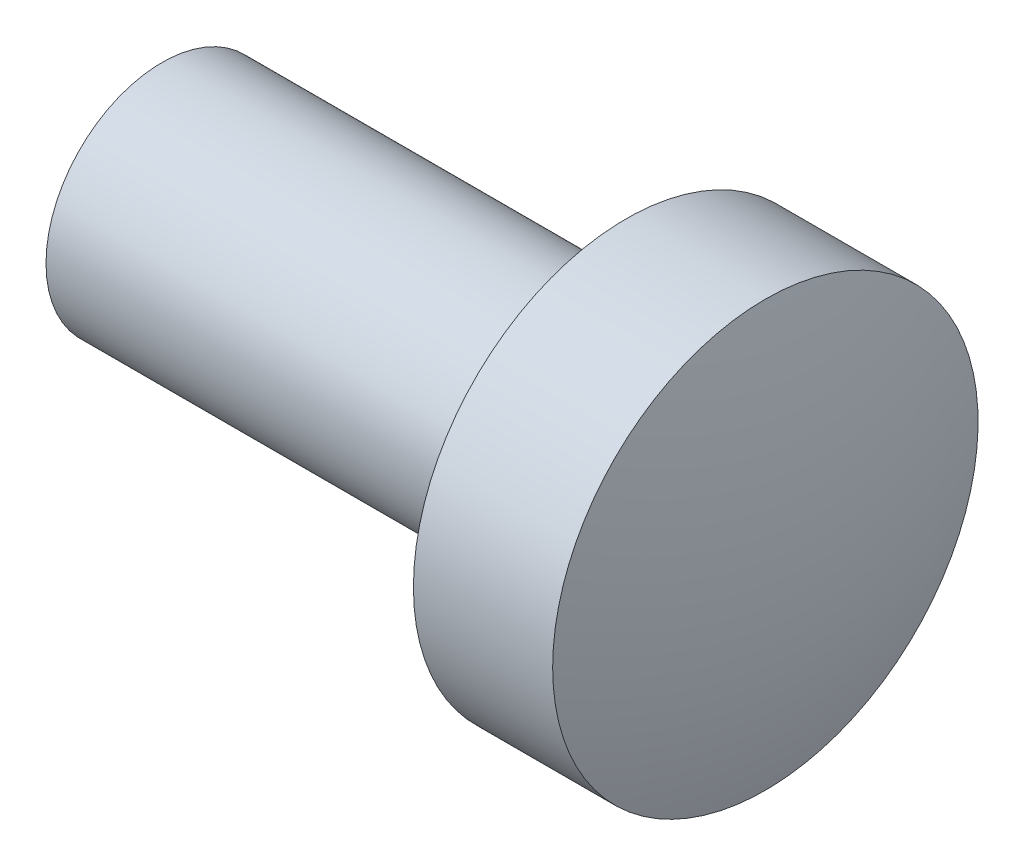
ISO-10303-21;
HEADER;
FILE_DESCRIPTION(('STEP AP214'),'2;1');
FILE_NAME('part.step','',(''),(''),'','','');
FILE_SCHEMA(('AUTOMOTIVE_DESIGN { 1 0 10303 214 1 1 1 1 }'));
ENDSEC;
DATA;
#1=APPLICATION_CONTEXT('core data for automotive mechanical design processes');
#2=APPLICATION_PROTOCOL_DEFINITION('international standard','automotive_design',2000,#1);
#3=PRODUCT_CONTEXT('',#1,'mechanical');
#4=PRODUCT('Part','Part','',(#3));
#5=PRODUCT_RELATED_PRODUCT_CATEGORY('part','',(#4));
#6=PRODUCT_DEFINITION_FORMATION('','',#4);
#7=PRODUCT_DEFINITION_CONTEXT('part definition',#1,'design');
#8=PRODUCT_DEFINITION('design','',#6,#7);
#9=PRODUCT_DEFINITION_SHAPE('','',#8);
#10=(LENGTH_UNIT() NAMED_UNIT(*) SI_UNIT(.MILLI.,.METRE.));
#11=(NAMED_UNIT(*) PLANE_ANGLE_UNIT() SI_UNIT($,.RADIAN.));
#12=(NAMED_UNIT(*) SI_UNIT($,.STERADIAN.) SOLID_ANGLE_UNIT());
#13=UNCERTAINTY_MEASURE_WITH_UNIT(LENGTH_MEASURE(1.E-05),#10,'distance_accuracy_value','');
#14=(GEOMETRIC_REPRESENTATION_CONTEXT(3) GLOBAL_UNCERTAINTY_ASSIGNED_CONTEXT((#13)) GLOBAL_UNIT_ASSIGNED_CONTEXT((#10,
#11,#12)) REPRESENTATION_CONTEXT('',''));
#15=CARTESIAN_POINT('',(0.,0.,0.));
#16=DIRECTION('',(0.,0.,1.));
#17=DIRECTION('',(1.,0.,0.));
#18=AXIS2_PLACEMENT_3D('',#15,#16,#17);
#19=CARTESIAN_POINT('',(-16.3013904795206,0.,0.));
#20=DIRECTION('',(-1.,0.,0.));
#21=DIRECTION('',(0.,0.,1.));
#22=AXIS2_PLACEMENT_3D('',#19,#20,#21);
#23=CYLINDRICAL_SURFACE('',#22,1.5);
#24=CARTESIAN_POINT('',(-6.,0.,0.));
#25=DIRECTION('',(-1.,0.,0.));
#26=DIRECTION('',(0.,0.,1.));
#27=AXIS2_PLACEMENT_3D('',#24,#25,#26);
#28=CIRCLE('',#27,1.5);
#29=CARTESIAN_POINT('',(-6.,0.,1.5));
#30=VERTEX_POINT('',#29);
#31=EDGE_CURVE('E44',#30,#30,#28,.T.);
#32=ORIENTED_EDGE('',*,*,#31,.F.);
#33=EDGE_LOOP('',(#32));
#34=FACE_BOUND('',#33,.T.);
#35=CARTESIAN_POINT('',(0.,0.,0.));
#36=DIRECTION('',(-1.,0.,0.));
#37=DIRECTION('',(0.,0.,1.));
#38=AXIS2_PLACEMENT_3D('',#35,#36,#37);
#39=CIRCLE('',#38,1.5);
#40=CARTESIAN_POINT('',(0.,0.,1.5));
#41=VERTEX_POINT('',#40);
#42=EDGE_CURVE('E10',#41,#41,#39,.T.);
#43=ORIENTED_EDGE('',*,*,#42,.T.);
#44=EDGE_LOOP('',(#43));
#45=FACE_BOUND('',#44,.T.);
#46=ADVANCED_FACE('F30',(#34,#45),#23,.T.);
#47=CARTESIAN_POINT('',(0.,1.5,0.));
#48=DIRECTION('',(1.,0.,0.));
#49=DIRECTION('',(0.,0.,-1.));
#50=AXIS2_PLACEMENT_3D('',#47,#48,#49);
#51=PLANE('',#50);
#52=ORIENTED_EDGE('',*,*,#42,.F.);
#53=EDGE_LOOP('',(#52));
#54=FACE_BOUND('',#53,.T.);
#55=CARTESIAN_POINT('',(0.,0.,0.));
#56=DIRECTION('',(-1.,0.,0.));
#57=DIRECTION('',(0.,0.,1.));
#58=AXIS2_PLACEMENT_3D('',#55,#56,#57);
#59=CIRCLE('',#58,2.75);
#60=CARTESIAN_POINT('',(0.,0.,2.75));
#61=VERTEX_POINT('',#60);
#62=EDGE_CURVE('E36',#61,#61,#59,.T.);
#63=ORIENTED_EDGE('',*,*,#62,.T.);
#64=EDGE_LOOP('',(#63));
#65=FACE_BOUND('',#64,.T.);
#66=ADVANCED_FACE('F53',(#54,#65),#51,.F.);
#67=CARTESIAN_POINT('',(-16.3013904795206,0.,0.));
#68=DIRECTION('',(-1.,0.,0.));
#69=DIRECTION('',(0.,0.,1.));
#70=AXIS2_PLACEMENT_3D('',#67,#68,#69);
#71=CYLINDRICAL_SURFACE('',#70,2.75);
#72=ORIENTED_EDGE('',*,*,#62,.F.);
#73=EDGE_LOOP('',(#72));
#74=FACE_BOUND('',#73,.T.);
#75=CARTESIAN_POINT('',(1.8,0.,0.));
#76=DIRECTION('',(-1.,0.,0.));
#77=DIRECTION('',(0.,0.,1.));
#78=AXIS2_PLACEMENT_3D('',#75,#76,#77);
#79=CIRCLE('',#78,2.75);
#80=CARTESIAN_POINT('',(1.8,0.,2.75));
#81=VERTEX_POINT('',#80);
#82=EDGE_CURVE('E40',#81,#81,#79,.T.);
#83=ORIENTED_EDGE('',*,*,#82,.T.);
#84=EDGE_LOOP('',(#83));
#85=FACE_BOUND('',#84,.T.);
#86=ADVANCED_FACE('F57',(#74,#85),#71,.T.);
#87=CARTESIAN_POINT('',(-7.45312499999999,0.,0.));
#88=DIRECTION('',(-1.,0.,0.));
#89=DIRECTION('',(0.,1.,0.));
#90=AXIS2_PLACEMENT_3D('',#87,#88,#89);
#91=SPHERICAL_SURFACE('',#90,9.65312499999999);
#92=ORIENTED_EDGE('',*,*,#82,.F.);
#93=EDGE_LOOP('',(#92));
#94=FACE_BOUND('',#93,.T.);
#95=ADVANCED_FACE('F62',(#94),#91,.T.);
#96=CARTESIAN_POINT('',(-6.,0.,0.));
#97=DIRECTION('',(1.,0.,0.));
#98=DIRECTION('',(0.,0.,-1.));
#99=AXIS2_PLACEMENT_3D('',#96,#97,#98);
#100=PLANE('',#99);
#101=ORIENTED_EDGE('',*,*,#31,.T.);
#102=EDGE_LOOP('',(#101));
#103=FACE_BOUND('',#102,.T.);
#104=ADVANCED_FACE('F50',(#103),#100,.F.);
#105=CLOSED_SHELL('',(#46,#66,#86,#95,#104));
#106=MANIFOLD_SOLID_BREP('B2',#105);
#107=ADVANCED_BREP_SHAPE_REPRESENTATION('',(#18,#106),#14);
#108=SHAPE_DEFINITION_REPRESENTATION(#9,#107);
ENDSEC;
END-ISO-10303-21;
